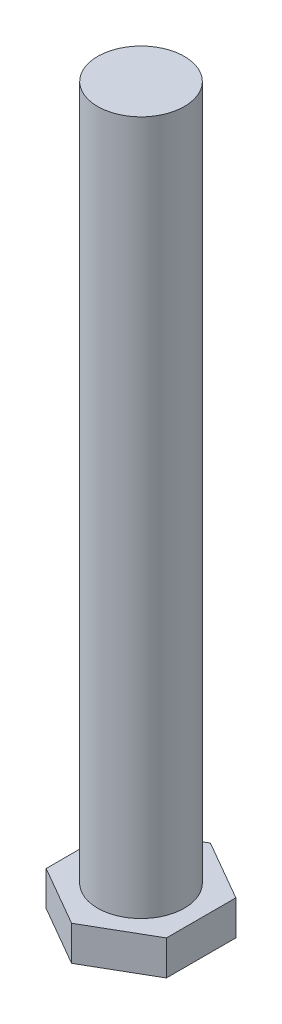
ISO-10303-21;
HEADER;
FILE_DESCRIPTION(('STEP AP214'),'2;1');
FILE_NAME('part.step','',(''),(''),'','','');
FILE_SCHEMA(('AUTOMOTIVE_DESIGN { 1 0 10303 214 1 1 1 1 }'));
ENDSEC;
DATA;
#1=APPLICATION_CONTEXT('core data for automotive mechanical design processes');
#2=APPLICATION_PROTOCOL_DEFINITION('international standard','automotive_design',2000,#1);
#3=PRODUCT_CONTEXT('',#1,'mechanical');
#4=PRODUCT('Part','Part','',(#3));
#5=PRODUCT_RELATED_PRODUCT_CATEGORY('part','',(#4));
#6=PRODUCT_DEFINITION_FORMATION('','',#4);
#7=PRODUCT_DEFINITION_CONTEXT('part definition',#1,'design');
#8=PRODUCT_DEFINITION('design','',#6,#7);
#9=PRODUCT_DEFINITION_SHAPE('','',#8);
#10=(LENGTH_UNIT() NAMED_UNIT(*) SI_UNIT(.MILLI.,.METRE.));
#11=(NAMED_UNIT(*) PLANE_ANGLE_UNIT() SI_UNIT($,.RADIAN.));
#12=(NAMED_UNIT(*) SI_UNIT($,.STERADIAN.) SOLID_ANGLE_UNIT());
#13=UNCERTAINTY_MEASURE_WITH_UNIT(LENGTH_MEASURE(1.E-05),#10,'distance_accuracy_value','');
#14=(GEOMETRIC_REPRESENTATION_CONTEXT(3) GLOBAL_UNCERTAINTY_ASSIGNED_CONTEXT((#13)) GLOBAL_UNIT_ASSIGNED_CONTEXT((#10,
#11,#12)) REPRESENTATION_CONTEXT('',''));
#15=CARTESIAN_POINT('',(0.,0.,0.));
#16=DIRECTION('',(0.,0.,1.));
#17=DIRECTION('',(1.,0.,0.));
#18=AXIS2_PLACEMENT_3D('',#15,#16,#17);
#19=CARTESIAN_POINT('',(0.,2.,0.));
#20=DIRECTION('',(0.,1.,0.));
#21=DIRECTION('',(0.,0.,1.));
#22=AXIS2_PLACEMENT_3D('',#19,#20,#21);
#23=PLANE('',#22);
#24=DIRECTION('',(0.866025403784445,0.,0.49999999999999));
#25=VECTOR('',#24,1.);
#26=CARTESIAN_POINT('',(1.73205080756884,2.,-3.00000000000002));
#27=LINE('',#26,#25);
#28=CARTESIAN_POINT('',(0.,2.,-4.));
#29=VERTEX_POINT('',#28);
#30=CARTESIAN_POINT('',(3.46410161513774,2.,-2.00000000000003));
#31=VERTEX_POINT('',#30);
#32=EDGE_CURVE('E164',#29,#31,#27,.T.);
#33=ORIENTED_EDGE('',*,*,#32,.F.);
#34=DIRECTION('',(0.866025403784439,0.,-0.5));
#35=VECTOR('',#34,1.);
#36=CARTESIAN_POINT('',(-1.73205080756888,2.,-3.));
#37=LINE('',#36,#35);
#38=CARTESIAN_POINT('',(-3.46410161513775,2.,-2.));
#39=VERTEX_POINT('',#38);
#40=EDGE_CURVE('E162',#39,#29,#37,.T.);
#41=ORIENTED_EDGE('',*,*,#40,.F.);
#42=DIRECTION('',(0.,0.,-1.));
#43=VECTOR('',#42,1.);
#44=CARTESIAN_POINT('',(-3.46410161513776,2.,0.));
#45=LINE('',#44,#43);
#46=CARTESIAN_POINT('',(-3.46410161513775,2.,2.00000000000001));
#47=VERTEX_POINT('',#46);
#48=EDGE_CURVE('E160',#47,#39,#45,.T.);
#49=ORIENTED_EDGE('',*,*,#48,.F.);
#50=DIRECTION('',(-0.866025403784441,0.,-0.499999999999996));
#51=VECTOR('',#50,1.);
#52=CARTESIAN_POINT('',(-1.73205080756886,2.,3.00000000000001));
#53=LINE('',#52,#51);
#54=CARTESIAN_POINT('',(0.,2.,4.));
#55=VERTEX_POINT('',#54);
#56=EDGE_CURVE('E158',#55,#47,#53,.T.);
#57=ORIENTED_EDGE('',*,*,#56,.F.);
#58=DIRECTION('',(-0.866025403784435,0.,0.500000000000006));
#59=VECTOR('',#58,1.);
#60=CARTESIAN_POINT('',(1.7320508075689,2.,2.99999999999999));
#61=LINE('',#60,#59);
#62=CARTESIAN_POINT('',(3.46410161513777,2.,1.99999999999998));
#63=VERTEX_POINT('',#62);
#64=EDGE_CURVE('E120',#63,#55,#61,.T.);
#65=ORIENTED_EDGE('',*,*,#64,.F.);
#66=DIRECTION('',(0.,0.,1.));
#67=VECTOR('',#66,1.);
#68=CARTESIAN_POINT('',(3.46410161513775,2.,0.));
#69=LINE('',#68,#67);
#70=EDGE_CURVE('E150',#31,#63,#69,.T.);
#71=ORIENTED_EDGE('',*,*,#70,.F.);
#72=EDGE_LOOP('',(#33,#41,#49,#57,#65,#71));
#73=FACE_BOUND('',#72,.T.);
#74=CARTESIAN_POINT('',(0.,2.,0.));
#75=DIRECTION('',(0.,1.,0.));
#76=DIRECTION('',(0.,0.,1.));
#77=AXIS2_PLACEMENT_3D('',#74,#75,#76);
#78=CIRCLE('',#77,2.5);
#79=CARTESIAN_POINT('',(0.,2.,2.5));
#80=VERTEX_POINT('',#79);
#81=EDGE_CURVE('E68',#80,#80,#78,.T.);
#82=ORIENTED_EDGE('',*,*,#81,.F.);
#83=EDGE_LOOP('',(#82));
#84=FACE_BOUND('',#83,.T.);
#85=ADVANCED_FACE('F64',(#73,#84),#23,.T.);
#86=CARTESIAN_POINT('',(0.,42.,0.));
#87=DIRECTION('',(0.,-1.,0.));
#88=DIRECTION('',(0.,0.,-1.));
#89=AXIS2_PLACEMENT_3D('',#86,#87,#88);
#90=CYLINDRICAL_SURFACE('',#89,2.5);
#91=CARTESIAN_POINT('',(0.,42.,0.));
#92=DIRECTION('',(0.,1.,0.));
#93=DIRECTION('',(0.,0.,1.));
#94=AXIS2_PLACEMENT_3D('',#91,#92,#93);
#95=CIRCLE('',#94,2.5);
#96=CARTESIAN_POINT('',(0.,42.,2.5));
#97=VERTEX_POINT('',#96);
#98=EDGE_CURVE('E13',#97,#97,#95,.T.);
#99=ORIENTED_EDGE('',*,*,#98,.F.);
#100=EDGE_LOOP('',(#99));
#101=FACE_BOUND('',#100,.T.);
#102=ORIENTED_EDGE('',*,*,#81,.T.);
#103=EDGE_LOOP('',(#102));
#104=FACE_BOUND('',#103,.T.);
#105=ADVANCED_FACE('F172',(#101,#104),#90,.T.);
#106=CARTESIAN_POINT('',(0.,42.,0.));
#107=DIRECTION('',(0.,1.,0.));
#108=DIRECTION('',(0.,0.,1.));
#109=AXIS2_PLACEMENT_3D('',#106,#107,#108);
#110=PLANE('',#109);
#111=ORIENTED_EDGE('',*,*,#98,.T.);
#112=EDGE_LOOP('',(#111));
#113=FACE_BOUND('',#112,.T.);
#114=ADVANCED_FACE('F181',(#113),#110,.T.);
#115=CARTESIAN_POINT('',(1.73205080756884,10.,-3.00000000000002));
#116=DIRECTION('',(-0.49999999999999,0.,0.866025403784445));
#117=DIRECTION('',(0.866025403784445,0.,0.49999999999999));
#118=AXIS2_PLACEMENT_3D('',#115,#116,#117);
#119=PLANE('',#118);
#120=ORIENTED_EDGE('',*,*,#32,.T.);
#121=DIRECTION('',(0.,-1.,0.));
#122=VECTOR('',#121,1.);
#123=CARTESIAN_POINT('',(3.46410161513774,10.,-2.00000000000003));
#124=LINE('',#123,#122);
#125=CARTESIAN_POINT('',(3.46410161513774,0.,-2.00000000000003));
#126=VERTEX_POINT('',#125);
#127=EDGE_CURVE('E79',#31,#126,#124,.T.);
#128=ORIENTED_EDGE('',*,*,#127,.T.);
#129=DIRECTION('',(-0.866025403784444,0.,-0.49999999999999));
#130=VECTOR('',#129,1.);
#131=CARTESIAN_POINT('',(1.73205080756884,0.,-3.00000000000002));
#132=LINE('',#131,#130);
#133=CARTESIAN_POINT('',(0.,0.,-4.));
#134=VERTEX_POINT('',#133);
#135=EDGE_CURVE('E140',#126,#134,#132,.T.);
#136=ORIENTED_EDGE('',*,*,#135,.T.);
#137=DIRECTION('',(0.,-1.,0.));
#138=VECTOR('',#137,1.);
#139=CARTESIAN_POINT('',(0.,10.,-4.));
#140=LINE('',#139,#138);
#141=EDGE_CURVE('E148',#29,#134,#140,.T.);
#142=ORIENTED_EDGE('',*,*,#141,.F.);
#143=EDGE_LOOP('',(#120,#128,#136,#142));
#144=FACE_BOUND('',#143,.T.);
#145=ADVANCED_FACE('F187',(#144),#119,.F.);
#146=CARTESIAN_POINT('',(-1.73205080756888,10.,-3.));
#147=DIRECTION('',(0.5,0.,0.866025403784439));
#148=DIRECTION('',(0.866025403784439,0.,-0.5));
#149=AXIS2_PLACEMENT_3D('',#146,#147,#148);
#150=PLANE('',#149);
#151=ORIENTED_EDGE('',*,*,#40,.T.);
#152=ORIENTED_EDGE('',*,*,#141,.T.);
#153=DIRECTION('',(-0.866025403784439,0.,0.5));
#154=VECTOR('',#153,1.);
#155=CARTESIAN_POINT('',(-1.73205080756888,0.,-3.));
#156=LINE('',#155,#154);
#157=CARTESIAN_POINT('',(-3.46410161513775,0.,-2.));
#158=VERTEX_POINT('',#157);
#159=EDGE_CURVE('E145',#134,#158,#156,.T.);
#160=ORIENTED_EDGE('',*,*,#159,.T.);
#161=DIRECTION('',(0.,-1.,0.));
#162=VECTOR('',#161,1.);
#163=CARTESIAN_POINT('',(-3.46410161513775,10.,-2.));
#164=LINE('',#163,#162);
#165=EDGE_CURVE('E151',#39,#158,#164,.T.);
#166=ORIENTED_EDGE('',*,*,#165,.F.);
#167=EDGE_LOOP('',(#151,#152,#160,#166));
#168=FACE_BOUND('',#167,.T.);
#169=ADVANCED_FACE('F191',(#168),#150,.F.);
#170=CARTESIAN_POINT('',(-3.46410161513776,10.,0.));
#171=DIRECTION('',(1.,0.,0.));
#172=DIRECTION('',(0.,0.,-1.));
#173=AXIS2_PLACEMENT_3D('',#170,#171,#172);
#174=PLANE('',#173);
#175=ORIENTED_EDGE('',*,*,#48,.T.);
#176=ORIENTED_EDGE('',*,*,#165,.T.);
#177=DIRECTION('',(0.,0.,1.));
#178=VECTOR('',#177,1.);
#179=CARTESIAN_POINT('',(-3.46410161513776,0.,0.));
#180=LINE('',#179,#178);
#181=CARTESIAN_POINT('',(-3.46410161513775,0.,2.00000000000001));
#182=VERTEX_POINT('',#181);
#183=EDGE_CURVE('E133',#158,#182,#180,.T.);
#184=ORIENTED_EDGE('',*,*,#183,.T.);
#185=DIRECTION('',(0.,-1.,0.));
#186=VECTOR('',#185,1.);
#187=CARTESIAN_POINT('',(-3.46410161513775,10.,2.00000000000001));
#188=LINE('',#187,#186);
#189=EDGE_CURVE('E123',#47,#182,#188,.T.);
#190=ORIENTED_EDGE('',*,*,#189,.F.);
#191=EDGE_LOOP('',(#175,#176,#184,#190));
#192=FACE_BOUND('',#191,.T.);
#193=ADVANCED_FACE('F199',(#192),#174,.F.);
#194=CARTESIAN_POINT('',(-1.73205080756886,10.,3.00000000000001));
#195=DIRECTION('',(0.499999999999996,0.,-0.866025403784441));
#196=DIRECTION('',(-0.866025403784441,0.,-0.499999999999996));
#197=AXIS2_PLACEMENT_3D('',#194,#195,#196);
#198=PLANE('',#197);
#199=ORIENTED_EDGE('',*,*,#56,.T.);
#200=ORIENTED_EDGE('',*,*,#189,.T.);
#201=DIRECTION('',(0.866025403784441,0.,0.499999999999996));
#202=VECTOR('',#201,1.);
#203=CARTESIAN_POINT('',(-1.73205080756886,0.,3.00000000000001));
#204=LINE('',#203,#202);
#205=CARTESIAN_POINT('',(0.,0.,4.));
#206=VERTEX_POINT('',#205);
#207=EDGE_CURVE('E127',#182,#206,#204,.T.);
#208=ORIENTED_EDGE('',*,*,#207,.T.);
#209=DIRECTION('',(0.,-1.,0.));
#210=VECTOR('',#209,1.);
#211=CARTESIAN_POINT('',(0.,10.,4.));
#212=LINE('',#211,#210);
#213=EDGE_CURVE('E116',#55,#206,#212,.T.);
#214=ORIENTED_EDGE('',*,*,#213,.F.);
#215=EDGE_LOOP('',(#199,#200,#208,#214));
#216=FACE_BOUND('',#215,.T.);
#217=ADVANCED_FACE('F128',(#216),#198,.F.);
#218=CARTESIAN_POINT('',(1.7320508075689,10.,2.99999999999999));
#219=DIRECTION('',(-0.500000000000006,0.,-0.866025403784435));
#220=DIRECTION('',(-0.866025403784435,0.,0.500000000000006));
#221=AXIS2_PLACEMENT_3D('',#218,#219,#220);
#222=PLANE('',#221);
#223=ORIENTED_EDGE('',*,*,#64,.T.);
#224=ORIENTED_EDGE('',*,*,#213,.T.);
#225=DIRECTION('',(0.866025403784435,0.,-0.500000000000006));
#226=VECTOR('',#225,1.);
#227=CARTESIAN_POINT('',(1.7320508075689,0.,2.99999999999999));
#228=LINE('',#227,#226);
#229=CARTESIAN_POINT('',(3.46410161513777,0.,1.99999999999997));
#230=VERTEX_POINT('',#229);
#231=EDGE_CURVE('E87',#206,#230,#228,.T.);
#232=ORIENTED_EDGE('',*,*,#231,.T.);
#233=DIRECTION('',(0.,-1.,0.));
#234=VECTOR('',#233,1.);
#235=CARTESIAN_POINT('',(3.46410161513777,10.,1.99999999999998));
#236=LINE('',#235,#234);
#237=EDGE_CURVE('E124',#63,#230,#236,.T.);
#238=ORIENTED_EDGE('',*,*,#237,.F.);
#239=EDGE_LOOP('',(#223,#224,#232,#238));
#240=FACE_BOUND('',#239,.T.);
#241=ADVANCED_FACE('F118',(#240),#222,.F.);
#242=CARTESIAN_POINT('',(3.46410161513775,10.,0.));
#243=DIRECTION('',(-1.,0.,0.));
#244=DIRECTION('',(0.,0.,1.));
#245=AXIS2_PLACEMENT_3D('',#242,#243,#244);
#246=PLANE('',#245);
#247=ORIENTED_EDGE('',*,*,#70,.T.);
#248=ORIENTED_EDGE('',*,*,#237,.T.);
#249=DIRECTION('',(0.,0.,-1.));
#250=VECTOR('',#249,1.);
#251=CARTESIAN_POINT('',(3.46410161513775,0.,0.));
#252=LINE('',#251,#250);
#253=EDGE_CURVE('E138',#230,#126,#252,.T.);
#254=ORIENTED_EDGE('',*,*,#253,.T.);
#255=ORIENTED_EDGE('',*,*,#127,.F.);
#256=EDGE_LOOP('',(#247,#248,#254,#255));
#257=FACE_BOUND('',#256,.T.);
#258=ADVANCED_FACE('F192',(#257),#246,.F.);
#259=CARTESIAN_POINT('',(0.,0.,0.));
#260=DIRECTION('',(0.,1.,0.));
#261=DIRECTION('',(0.,0.,1.));
#262=AXIS2_PLACEMENT_3D('',#259,#260,#261);
#263=PLANE('',#262);
#264=ORIENTED_EDGE('',*,*,#159,.F.);
#265=ORIENTED_EDGE('',*,*,#135,.F.);
#266=ORIENTED_EDGE('',*,*,#253,.F.);
#267=ORIENTED_EDGE('',*,*,#231,.F.);
#268=ORIENTED_EDGE('',*,*,#207,.F.);
#269=ORIENTED_EDGE('',*,*,#183,.F.);
#270=EDGE_LOOP('',(#264,#265,#266,#267,#268,#269));
#271=FACE_BOUND('',#270,.T.);
#272=ADVANCED_FACE('F66',(#271),#263,.F.);
#273=CLOSED_SHELL('',(#85,#105,#114,#145,#169,#193,#217,#241,#258,#272));
#274=MANIFOLD_SOLID_BREP('B2',#273);
#275=ADVANCED_BREP_SHAPE_REPRESENTATION('',(#18,#274),#14);
#276=SHAPE_DEFINITION_REPRESENTATION(#9,#275);
ENDSEC;
END-ISO-10303-21;
